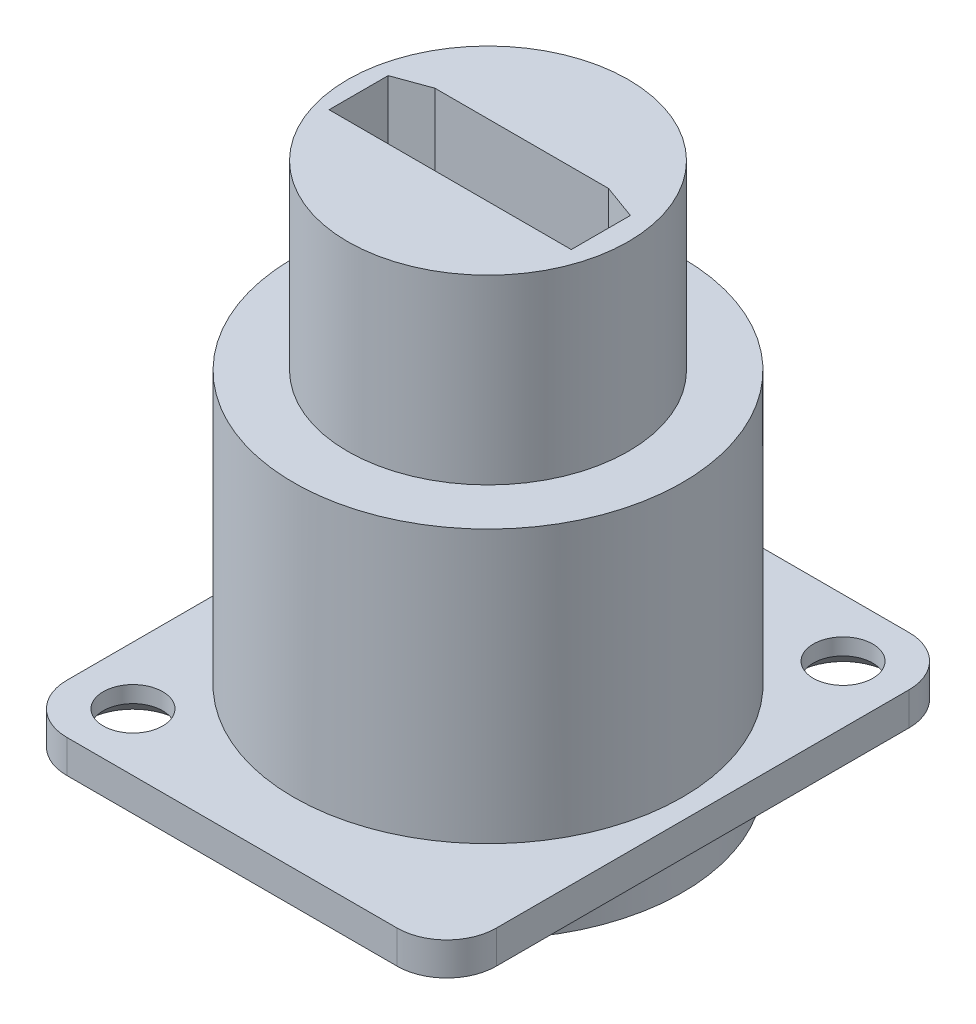
ISO-10303-21;
HEADER;
FILE_DESCRIPTION(('STEP AP214'),'2;1');
FILE_NAME('part.step','',(''),(''),'','','');
FILE_SCHEMA(('AUTOMOTIVE_DESIGN { 1 0 10303 214 1 1 1 1 }'));
ENDSEC;
DATA;
#1=APPLICATION_CONTEXT('core data for automotive mechanical design processes');
#2=APPLICATION_PROTOCOL_DEFINITION('international standard','automotive_design',2000,#1);
#3=PRODUCT_CONTEXT('',#1,'mechanical');
#4=PRODUCT('Part','Part','',(#3));
#5=PRODUCT_RELATED_PRODUCT_CATEGORY('part','',(#4));
#6=PRODUCT_DEFINITION_FORMATION('','',#4);
#7=PRODUCT_DEFINITION_CONTEXT('part definition',#1,'design');
#8=PRODUCT_DEFINITION('design','',#6,#7);
#9=PRODUCT_DEFINITION_SHAPE('','',#8);
#10=(LENGTH_UNIT() NAMED_UNIT(*) SI_UNIT(.MILLI.,.METRE.));
#11=(NAMED_UNIT(*) PLANE_ANGLE_UNIT() SI_UNIT($,.RADIAN.));
#12=(NAMED_UNIT(*) SI_UNIT($,.STERADIAN.) SOLID_ANGLE_UNIT());
#13=UNCERTAINTY_MEASURE_WITH_UNIT(LENGTH_MEASURE(1.E-05),#10,'distance_accuracy_value','');
#14=(GEOMETRIC_REPRESENTATION_CONTEXT(3) GLOBAL_UNCERTAINTY_ASSIGNED_CONTEXT((#13)) GLOBAL_UNIT_ASSIGNED_CONTEXT((#10,
#11,#12)) REPRESENTATION_CONTEXT('',''));
#15=CARTESIAN_POINT('',(0.,0.,0.));
#16=DIRECTION('',(0.,0.,1.));
#17=DIRECTION('',(1.,0.,0.));
#18=AXIS2_PLACEMENT_3D('',#15,#16,#17);
#19=CARTESIAN_POINT('',(0.,2.,0.));
#20=DIRECTION('',(1.,0.,0.));
#21=DIRECTION('',(0.,0.,-1.));
#22=AXIS2_PLACEMENT_3D('',#19,#20,#21);
#23=PLANE('',#22);
#24=DIRECTION('',(0.,0.,1.));
#25=VECTOR('',#24,1.);
#26=CARTESIAN_POINT('',(0.,0.,0.));
#27=LINE('',#26,#25);
#28=CARTESIAN_POINT('',(0.,0.,3.));
#29=VERTEX_POINT('',#28);
#30=CARTESIAN_POINT('',(0.,0.,28.));
#31=VERTEX_POINT('',#30);
#32=EDGE_CURVE('E319',#29,#31,#27,.T.);
#33=ORIENTED_EDGE('',*,*,#32,.T.);
#34=DIRECTION('',(0.,-1.,0.));
#35=VECTOR('',#34,1.);
#36=CARTESIAN_POINT('',(0.,2.,28.));
#37=LINE('',#36,#35);
#38=CARTESIAN_POINT('',(0.,2.,28.));
#39=VERTEX_POINT('',#38);
#40=EDGE_CURVE('E374',#31,#39,#37,.F.);
#41=ORIENTED_EDGE('',*,*,#40,.T.);
#42=DIRECTION('',(0.,0.,1.));
#43=VECTOR('',#42,1.);
#44=CARTESIAN_POINT('',(0.,2.,0.));
#45=LINE('',#44,#43);
#46=CARTESIAN_POINT('',(0.,2.,3.));
#47=VERTEX_POINT('',#46);
#48=EDGE_CURVE('E308',#47,#39,#45,.T.);
#49=ORIENTED_EDGE('',*,*,#48,.F.);
#50=DIRECTION('',(0.,-1.,0.));
#51=VECTOR('',#50,1.);
#52=CARTESIAN_POINT('',(0.,2.,3.));
#53=LINE('',#52,#51);
#54=EDGE_CURVE('E371',#47,#29,#53,.T.);
#55=ORIENTED_EDGE('',*,*,#54,.T.);
#56=EDGE_LOOP('',(#33,#41,#49,#55));
#57=FACE_BOUND('',#56,.T.);
#58=ADVANCED_FACE('F36',(#57),#23,.F.);
#59=CARTESIAN_POINT('',(0.,2.,31.));
#60=DIRECTION('',(0.,0.,-1.));
#61=DIRECTION('',(-1.,0.,0.));
#62=AXIS2_PLACEMENT_3D('',#59,#60,#61);
#63=PLANE('',#62);
#64=DIRECTION('',(1.,0.,0.));
#65=VECTOR('',#64,1.);
#66=CARTESIAN_POINT('',(0.,0.,31.));
#67=LINE('',#66,#65);
#68=CARTESIAN_POINT('',(3.,0.,31.));
#69=VERTEX_POINT('',#68);
#70=CARTESIAN_POINT('',(23.,0.,31.));
#71=VERTEX_POINT('',#70);
#72=EDGE_CURVE('E322',#69,#71,#67,.T.);
#73=ORIENTED_EDGE('',*,*,#72,.T.);
#74=DIRECTION('',(0.,-1.,0.));
#75=VECTOR('',#74,1.);
#76=CARTESIAN_POINT('',(23.,2.,31.));
#77=LINE('',#76,#75);
#78=CARTESIAN_POINT('',(23.,2.,31.));
#79=VERTEX_POINT('',#78);
#80=EDGE_CURVE('E361',#71,#79,#77,.F.);
#81=ORIENTED_EDGE('',*,*,#80,.T.);
#82=DIRECTION('',(1.,0.,0.));
#83=VECTOR('',#82,1.);
#84=CARTESIAN_POINT('',(0.,2.,31.));
#85=LINE('',#84,#83);
#86=CARTESIAN_POINT('',(3.,2.,31.));
#87=VERTEX_POINT('',#86);
#88=EDGE_CURVE('E311',#87,#79,#85,.T.);
#89=ORIENTED_EDGE('',*,*,#88,.F.);
#90=DIRECTION('',(0.,-1.,0.));
#91=VECTOR('',#90,1.);
#92=CARTESIAN_POINT('',(3.,2.,31.));
#93=LINE('',#92,#91);
#94=EDGE_CURVE('E358',#87,#69,#93,.T.);
#95=ORIENTED_EDGE('',*,*,#94,.T.);
#96=EDGE_LOOP('',(#73,#81,#89,#95));
#97=FACE_BOUND('',#96,.T.);
#98=ADVANCED_FACE('F401',(#97),#63,.F.);
#99=CARTESIAN_POINT('',(26.,2.,0.));
#100=DIRECTION('',(-1.,0.,0.));
#101=DIRECTION('',(0.,0.,1.));
#102=AXIS2_PLACEMENT_3D('',#99,#100,#101);
#103=PLANE('',#102);
#104=DIRECTION('',(0.,0.,-1.));
#105=VECTOR('',#104,1.);
#106=CARTESIAN_POINT('',(26.,2.,0.));
#107=LINE('',#106,#105);
#108=CARTESIAN_POINT('',(26.,2.,28.));
#109=VERTEX_POINT('',#108);
#110=CARTESIAN_POINT('',(26.,2.,3.));
#111=VERTEX_POINT('',#110);
#112=EDGE_CURVE('E315',#109,#111,#107,.T.);
#113=ORIENTED_EDGE('',*,*,#112,.F.);
#114=DIRECTION('',(0.,-1.,0.));
#115=VECTOR('',#114,1.);
#116=CARTESIAN_POINT('',(26.,2.,28.));
#117=LINE('',#116,#115);
#118=CARTESIAN_POINT('',(26.,0.,28.));
#119=VERTEX_POINT('',#118);
#120=EDGE_CURVE('E347',#109,#119,#117,.T.);
#121=ORIENTED_EDGE('',*,*,#120,.T.);
#122=DIRECTION('',(0.,0.,-1.));
#123=VECTOR('',#122,1.);
#124=CARTESIAN_POINT('',(26.,0.,0.));
#125=LINE('',#124,#123);
#126=CARTESIAN_POINT('',(26.,0.,3.));
#127=VERTEX_POINT('',#126);
#128=EDGE_CURVE('E325',#119,#127,#125,.T.);
#129=ORIENTED_EDGE('',*,*,#128,.T.);
#130=DIRECTION('',(0.,-1.,0.));
#131=VECTOR('',#130,1.);
#132=CARTESIAN_POINT('',(26.,2.,3.));
#133=LINE('',#132,#131);
#134=EDGE_CURVE('E345',#127,#111,#133,.F.);
#135=ORIENTED_EDGE('',*,*,#134,.T.);
#136=EDGE_LOOP('',(#113,#121,#129,#135));
#137=FACE_BOUND('',#136,.T.);
#138=ADVANCED_FACE('F409',(#137),#103,.F.);
#139=CARTESIAN_POINT('',(0.,2.,0.));
#140=DIRECTION('',(0.,0.,1.));
#141=DIRECTION('',(1.,0.,0.));
#142=AXIS2_PLACEMENT_3D('',#139,#140,#141);
#143=PLANE('',#142);
#144=DIRECTION('',(-1.,0.,0.));
#145=VECTOR('',#144,1.);
#146=CARTESIAN_POINT('',(0.,0.,0.));
#147=LINE('',#146,#145);
#148=CARTESIAN_POINT('',(23.,0.,0.));
#149=VERTEX_POINT('',#148);
#150=CARTESIAN_POINT('',(3.,0.,0.));
#151=VERTEX_POINT('',#150);
#152=EDGE_CURVE('E312',#149,#151,#147,.T.);
#153=ORIENTED_EDGE('',*,*,#152,.T.);
#154=DIRECTION('',(0.,-1.,0.));
#155=VECTOR('',#154,1.);
#156=CARTESIAN_POINT('',(3.,2.,0.));
#157=LINE('',#156,#155);
#158=CARTESIAN_POINT('',(3.,2.,0.));
#159=VERTEX_POINT('',#158);
#160=EDGE_CURVE('E11',#151,#159,#157,.F.);
#161=ORIENTED_EDGE('',*,*,#160,.T.);
#162=DIRECTION('',(-1.,0.,0.));
#163=VECTOR('',#162,1.);
#164=CARTESIAN_POINT('',(0.,2.,0.));
#165=LINE('',#164,#163);
#166=CARTESIAN_POINT('',(23.,2.,0.));
#167=VERTEX_POINT('',#166);
#168=EDGE_CURVE('E307',#167,#159,#165,.T.);
#169=ORIENTED_EDGE('',*,*,#168,.F.);
#170=DIRECTION('',(0.,-1.,0.));
#171=VECTOR('',#170,1.);
#172=CARTESIAN_POINT('',(23.,2.,0.));
#173=LINE('',#172,#171);
#174=EDGE_CURVE('E44',#167,#149,#173,.T.);
#175=ORIENTED_EDGE('',*,*,#174,.T.);
#176=EDGE_LOOP('',(#153,#161,#169,#175));
#177=FACE_BOUND('',#176,.T.);
#178=ADVANCED_FACE('F378',(#177),#143,.F.);
#179=CARTESIAN_POINT('',(0.,2.,0.));
#180=DIRECTION('',(0.,1.,0.));
#181=DIRECTION('',(0.,0.,1.));
#182=AXIS2_PLACEMENT_3D('',#179,#180,#181);
#183=PLANE('',#182);
#184=CARTESIAN_POINT('',(22.5,2.,3.5));
#185=DIRECTION('',(0.,1.,0.));
#186=DIRECTION('',(0.,0.,1.));
#187=AXIS2_PLACEMENT_3D('',#184,#185,#186);
#188=CIRCLE('',#187,1.8);
#189=CARTESIAN_POINT('',(22.5,2.,5.3));
#190=VERTEX_POINT('',#189);
#191=EDGE_CURVE('E220',#190,#190,#188,.T.);
#192=ORIENTED_EDGE('',*,*,#191,.F.);
#193=EDGE_LOOP('',(#192));
#194=FACE_BOUND('',#193,.T.);
#195=CARTESIAN_POINT('',(3.5,2.,27.5));
#196=DIRECTION('',(0.,1.,0.));
#197=DIRECTION('',(0.,0.,1.));
#198=AXIS2_PLACEMENT_3D('',#195,#196,#197);
#199=CIRCLE('',#198,1.8);
#200=CARTESIAN_POINT('',(3.5,2.,29.3));
#201=VERTEX_POINT('',#200);
#202=EDGE_CURVE('E230',#201,#201,#199,.T.);
#203=ORIENTED_EDGE('',*,*,#202,.F.);
#204=EDGE_LOOP('',(#203));
#205=FACE_BOUND('',#204,.T.);
#206=CARTESIAN_POINT('',(13.,2.,15.5));
#207=DIRECTION('',(0.,1.,0.));
#208=DIRECTION('',(0.,0.,1.));
#209=AXIS2_PLACEMENT_3D('',#206,#207,#208);
#210=CIRCLE('',#209,11.775);
#211=CARTESIAN_POINT('',(13.,2.,27.275));
#212=VERTEX_POINT('',#211);
#213=EDGE_CURVE('E303',#212,#212,#210,.T.);
#214=ORIENTED_EDGE('',*,*,#213,.F.);
#215=EDGE_LOOP('',(#214));
#216=FACE_BOUND('',#215,.T.);
#217=ORIENTED_EDGE('',*,*,#88,.T.);
#218=CARTESIAN_POINT('',(23.,2.,28.));
#219=DIRECTION('',(0.,1.,0.));
#220=DIRECTION('',(0.,0.,1.));
#221=AXIS2_PLACEMENT_3D('',#218,#219,#220);
#222=CIRCLE('',#221,3.);
#223=EDGE_CURVE('E369',#79,#109,#222,.T.);
#224=ORIENTED_EDGE('',*,*,#223,.T.);
#225=ORIENTED_EDGE('',*,*,#112,.T.);
#226=CARTESIAN_POINT('',(23.,2.,3.));
#227=DIRECTION('',(0.,1.,0.));
#228=DIRECTION('',(0.,0.,1.));
#229=AXIS2_PLACEMENT_3D('',#226,#227,#228);
#230=CIRCLE('',#229,3.);
#231=EDGE_CURVE('E363',#111,#167,#230,.T.);
#232=ORIENTED_EDGE('',*,*,#231,.T.);
#233=ORIENTED_EDGE('',*,*,#168,.T.);
#234=CARTESIAN_POINT('',(3.,2.,3.));
#235=DIRECTION('',(0.,1.,0.));
#236=DIRECTION('',(0.,0.,1.));
#237=AXIS2_PLACEMENT_3D('',#234,#235,#236);
#238=CIRCLE('',#237,3.);
#239=EDGE_CURVE('E365',#159,#47,#238,.T.);
#240=ORIENTED_EDGE('',*,*,#239,.T.);
#241=ORIENTED_EDGE('',*,*,#48,.T.);
#242=CARTESIAN_POINT('',(3.,2.,28.));
#243=DIRECTION('',(0.,1.,0.));
#244=DIRECTION('',(0.,0.,1.));
#245=AXIS2_PLACEMENT_3D('',#242,#243,#244);
#246=CIRCLE('',#245,3.);
#247=EDGE_CURVE('E367',#39,#87,#246,.T.);
#248=ORIENTED_EDGE('',*,*,#247,.T.);
#249=EDGE_LOOP('',(#217,#224,#225,#232,#233,#240,#241,#248));
#250=FACE_BOUND('',#249,.T.);
#251=ADVANCED_FACE('F394',(#194,#205,#216,#250),#183,.T.);
#252=CARTESIAN_POINT('',(0.,0.,0.));
#253=DIRECTION('',(0.,1.,0.));
#254=DIRECTION('',(0.,0.,1.));
#255=AXIS2_PLACEMENT_3D('',#252,#253,#254);
#256=PLANE('',#255);
#257=CARTESIAN_POINT('',(22.5,0.,3.5));
#258=DIRECTION('',(0.,1.,0.));
#259=DIRECTION('',(0.,0.,1.));
#260=AXIS2_PLACEMENT_3D('',#257,#258,#259);
#261=CIRCLE('',#260,2.80000000000002);
#262=CARTESIAN_POINT('',(22.5,0.,6.30000000000002));
#263=VERTEX_POINT('',#262);
#264=EDGE_CURVE('E339',#263,#263,#261,.T.);
#265=ORIENTED_EDGE('',*,*,#264,.T.);
#266=EDGE_LOOP('',(#265));
#267=FACE_BOUND('',#266,.T.);
#268=CARTESIAN_POINT('',(3.5,0.,27.5));
#269=DIRECTION('',(0.,1.,0.));
#270=DIRECTION('',(0.,0.,1.));
#271=AXIS2_PLACEMENT_3D('',#268,#269,#270);
#272=CIRCLE('',#271,2.80000000000002);
#273=CARTESIAN_POINT('',(3.5,0.,30.3));
#274=VERTEX_POINT('',#273);
#275=EDGE_CURVE('E336',#274,#274,#272,.T.);
#276=ORIENTED_EDGE('',*,*,#275,.T.);
#277=EDGE_LOOP('',(#276));
#278=FACE_BOUND('',#277,.T.);
#279=CARTESIAN_POINT('',(13.,0.,15.5));
#280=DIRECTION('',(0.,1.,0.));
#281=DIRECTION('',(0.,0.,1.));
#282=AXIS2_PLACEMENT_3D('',#279,#280,#281);
#283=CIRCLE('',#282,11.775);
#284=CARTESIAN_POINT('',(13.,0.,27.275));
#285=VERTEX_POINT('',#284);
#286=EDGE_CURVE('E302',#285,#285,#283,.T.);
#287=ORIENTED_EDGE('',*,*,#286,.T.);
#288=EDGE_LOOP('',(#287));
#289=FACE_BOUND('',#288,.T.);
#290=ORIENTED_EDGE('',*,*,#128,.F.);
#291=CARTESIAN_POINT('',(23.,0.,28.));
#292=DIRECTION('',(0.,1.,0.));
#293=DIRECTION('',(0.,0.,1.));
#294=AXIS2_PLACEMENT_3D('',#291,#292,#293);
#295=CIRCLE('',#294,3.);
#296=EDGE_CURVE('E356',#119,#71,#295,.F.);
#297=ORIENTED_EDGE('',*,*,#296,.T.);
#298=ORIENTED_EDGE('',*,*,#72,.F.);
#299=CARTESIAN_POINT('',(3.,0.,28.));
#300=DIRECTION('',(0.,1.,0.));
#301=DIRECTION('',(0.,0.,1.));
#302=AXIS2_PLACEMENT_3D('',#299,#300,#301);
#303=CIRCLE('',#302,3.);
#304=EDGE_CURVE('E354',#69,#31,#303,.F.);
#305=ORIENTED_EDGE('',*,*,#304,.T.);
#306=ORIENTED_EDGE('',*,*,#32,.F.);
#307=CARTESIAN_POINT('',(3.,0.,3.));
#308=DIRECTION('',(0.,1.,0.));
#309=DIRECTION('',(0.,0.,1.));
#310=AXIS2_PLACEMENT_3D('',#307,#308,#309);
#311=CIRCLE('',#310,3.);
#312=EDGE_CURVE('E352',#29,#151,#311,.F.);
#313=ORIENTED_EDGE('',*,*,#312,.T.);
#314=ORIENTED_EDGE('',*,*,#152,.F.);
#315=CARTESIAN_POINT('',(23.,0.,3.));
#316=DIRECTION('',(0.,1.,0.));
#317=DIRECTION('',(0.,0.,1.));
#318=AXIS2_PLACEMENT_3D('',#315,#316,#317);
#319=CIRCLE('',#318,3.);
#320=EDGE_CURVE('E350',#149,#127,#319,.F.);
#321=ORIENTED_EDGE('',*,*,#320,.T.);
#322=EDGE_LOOP('',(#290,#297,#298,#305,#306,#313,#314,#321));
#323=FACE_BOUND('',#322,.T.);
#324=ADVANCED_FACE('F383',(#267,#278,#289,#323),#256,.F.);
#325=CARTESIAN_POINT('',(13.,-3.,15.5));
#326=DIRECTION('',(0.,-1.,0.));
#327=DIRECTION('',(0.,0.,-1.));
#328=AXIS2_PLACEMENT_3D('',#325,#326,#327);
#329=PLANE('',#328);
#330=CARTESIAN_POINT('',(13.,-3.,15.5));
#331=DIRECTION('',(0.,-1.,0.));
#332=DIRECTION('',(0.,0.,-1.));
#333=AXIS2_PLACEMENT_3D('',#330,#331,#332);
#334=CIRCLE('',#333,10.);
#335=CARTESIAN_POINT('',(13.,-3.,5.5));
#336=VERTEX_POINT('',#335);
#337=EDGE_CURVE('E285',#336,#336,#334,.T.);
#338=ORIENTED_EDGE('',*,*,#337,.F.);
#339=EDGE_LOOP('',(#338));
#340=FACE_BOUND('',#339,.T.);
#341=CARTESIAN_POINT('',(13.,-3.,15.5));
#342=DIRECTION('',(0.,-1.,0.));
#343=DIRECTION('',(0.,0.,-1.));
#344=AXIS2_PLACEMENT_3D('',#341,#342,#343);
#345=CIRCLE('',#344,11.775);
#346=CARTESIAN_POINT('',(13.,-3.,3.725));
#347=VERTEX_POINT('',#346);
#348=EDGE_CURVE('E296',#347,#347,#345,.T.);
#349=ORIENTED_EDGE('',*,*,#348,.T.);
#350=EDGE_LOOP('',(#349));
#351=FACE_BOUND('',#350,.T.);
#352=ADVANCED_FACE('F581',(#340,#351),#329,.T.);
#353=CARTESIAN_POINT('',(13.,18.5,15.5));
#354=DIRECTION('',(0.,-1.,0.));
#355=DIRECTION('',(0.,0.,-1.));
#356=AXIS2_PLACEMENT_3D('',#353,#354,#355);
#357=CYLINDRICAL_SURFACE('',#356,11.775);
#358=ORIENTED_EDGE('',*,*,#348,.F.);
#359=EDGE_LOOP('',(#358));
#360=FACE_BOUND('',#359,.T.);
#361=ORIENTED_EDGE('',*,*,#286,.F.);
#362=EDGE_LOOP('',(#361));
#363=FACE_BOUND('',#362,.T.);
#364=ADVANCED_FACE('F584',(#360,#363),#357,.T.);
#365=ORIENTED_EDGE('',*,*,#213,.T.);
#366=EDGE_LOOP('',(#365));
#367=FACE_BOUND('',#366,.T.);
#368=CARTESIAN_POINT('',(13.,18.5,15.5));
#369=DIRECTION('',(0.,-1.,0.));
#370=DIRECTION('',(0.,0.,-1.));
#371=AXIS2_PLACEMENT_3D('',#368,#369,#370);
#372=CIRCLE('',#371,11.775);
#373=CARTESIAN_POINT('',(13.,18.5,3.725));
#374=VERTEX_POINT('',#373);
#375=EDGE_CURVE('E299',#374,#374,#372,.T.);
#376=ORIENTED_EDGE('',*,*,#375,.T.);
#377=EDGE_LOOP('',(#376));
#378=FACE_BOUND('',#377,.T.);
#379=ADVANCED_FACE('F588',(#367,#378),#357,.T.);
#380=CARTESIAN_POINT('',(13.,18.5,15.5));
#381=DIRECTION('',(0.,-1.,0.));
#382=DIRECTION('',(0.,0.,-1.));
#383=AXIS2_PLACEMENT_3D('',#380,#381,#382);
#384=PLANE('',#383);
#385=CARTESIAN_POINT('',(13.,18.5,15.5));
#386=DIRECTION('',(0.,-1.,0.));
#387=DIRECTION('',(0.,0.,-1.));
#388=AXIS2_PLACEMENT_3D('',#385,#386,#387);
#389=CIRCLE('',#388,8.5);
#390=CARTESIAN_POINT('',(13.,18.5,7.));
#391=VERTEX_POINT('',#390);
#392=EDGE_CURVE('E306',#391,#391,#389,.F.);
#393=ORIENTED_EDGE('',*,*,#392,.F.);
#394=EDGE_LOOP('',(#393));
#395=FACE_BOUND('',#394,.T.);
#396=ORIENTED_EDGE('',*,*,#375,.F.);
#397=EDGE_LOOP('',(#396));
#398=FACE_BOUND('',#397,.T.);
#399=ADVANCED_FACE('F579',(#395,#398),#384,.F.);
#400=CARTESIAN_POINT('',(13.,29.5,15.5));
#401=DIRECTION('',(0.,-1.,0.));
#402=DIRECTION('',(0.,0.,-1.));
#403=AXIS2_PLACEMENT_3D('',#400,#401,#402);
#404=CYLINDRICAL_SURFACE('',#403,8.5);
#405=CARTESIAN_POINT('',(13.,29.5,15.5));
#406=DIRECTION('',(0.,1.,0.));
#407=DIRECTION('',(0.,0.,1.));
#408=AXIS2_PLACEMENT_3D('',#405,#406,#407);
#409=CIRCLE('',#408,8.5);
#410=CARTESIAN_POINT('',(13.,29.5,24.));
#411=VERTEX_POINT('',#410);
#412=EDGE_CURVE('E291',#411,#411,#409,.T.);
#413=ORIENTED_EDGE('',*,*,#412,.F.);
#414=EDGE_LOOP('',(#413));
#415=FACE_BOUND('',#414,.T.);
#416=ORIENTED_EDGE('',*,*,#392,.T.);
#417=EDGE_LOOP('',(#416));
#418=FACE_BOUND('',#417,.T.);
#419=ADVANCED_FACE('F462',(#415,#418),#404,.T.);
#420=CARTESIAN_POINT('',(13.,29.5,15.5));
#421=DIRECTION('',(0.,1.,0.));
#422=DIRECTION('',(0.,0.,1.));
#423=AXIS2_PLACEMENT_3D('',#420,#421,#422);
#424=PLANE('',#423);
#425=DIRECTION('',(1.,0.,0.));
#426=VECTOR('',#425,1.);
#427=CARTESIAN_POINT('',(5.51929511315663,29.5,17.6438599667552));
#428=LINE('',#427,#426);
#429=CARTESIAN_POINT('',(5.51929511315663,29.5,17.6438599667552));
#430=VERTEX_POINT('',#429);
#431=CARTESIAN_POINT('',(20.1870832638669,29.5,17.6438599667552));
#432=VERTEX_POINT('',#431);
#433=EDGE_CURVE('E51',#430,#432,#428,.T.);
#434=ORIENTED_EDGE('',*,*,#433,.F.);
#435=DIRECTION('',(0.,0.,1.));
#436=VECTOR('',#435,1.);
#437=CARTESIAN_POINT('',(5.51929511315663,29.5,14.0654876489084));
#438=LINE('',#437,#436);
#439=CARTESIAN_POINT('',(5.51929511315663,29.5,14.0654876489084));
#440=VERTEX_POINT('',#439);
#441=EDGE_CURVE('E194',#440,#430,#438,.T.);
#442=ORIENTED_EDGE('',*,*,#441,.F.);
#443=DIRECTION('',(-0.939692620785909,0.,0.342020143325666));
#444=VECTOR('',#443,1.);
#445=CARTESIAN_POINT('',(7.59666718443264,29.5,13.309386049468));
#446=LINE('',#445,#444);
#447=CARTESIAN_POINT('',(7.59666718443264,29.5,13.309386049468));
#448=VERTEX_POINT('',#447);
#449=EDGE_CURVE('E197',#448,#440,#446,.T.);
#450=ORIENTED_EDGE('',*,*,#449,.F.);
#451=DIRECTION('',(-1.,0.,0.));
#452=VECTOR('',#451,1.);
#453=CARTESIAN_POINT('',(18.1097111925909,29.5,13.309386049468));
#454=LINE('',#453,#452);
#455=CARTESIAN_POINT('',(18.1097111925909,29.5,13.309386049468));
#456=VERTEX_POINT('',#455);
#457=EDGE_CURVE('E213',#456,#448,#454,.T.);
#458=ORIENTED_EDGE('',*,*,#457,.F.);
#459=DIRECTION('',(-0.939692620785907,0.,-0.342020143325672));
#460=VECTOR('',#459,1.);
#461=CARTESIAN_POINT('',(20.1870832638669,29.5,14.0654876489084));
#462=LINE('',#461,#460);
#463=CARTESIAN_POINT('',(20.1870832638669,29.5,14.0654876489084));
#464=VERTEX_POINT('',#463);
#465=EDGE_CURVE('E210',#464,#456,#462,.T.);
#466=ORIENTED_EDGE('',*,*,#465,.F.);
#467=DIRECTION('',(0.,0.,-1.));
#468=VECTOR('',#467,1.);
#469=CARTESIAN_POINT('',(20.1870832638669,29.5,17.6438599667552));
#470=LINE('',#469,#468);
#471=EDGE_CURVE('E208',#432,#464,#470,.T.);
#472=ORIENTED_EDGE('',*,*,#471,.F.);
#473=EDGE_LOOP('',(#434,#442,#450,#458,#466,#472));
#474=FACE_BOUND('',#473,.T.);
#475=ORIENTED_EDGE('',*,*,#412,.T.);
#476=EDGE_LOOP('',(#475));
#477=FACE_BOUND('',#476,.T.);
#478=ADVANCED_FACE('F456',(#474,#477),#424,.T.);
#479=CARTESIAN_POINT('',(13.,12.,15.5));
#480=DIRECTION('',(0.,-1.,0.));
#481=DIRECTION('',(0.,0.,-1.));
#482=AXIS2_PLACEMENT_3D('',#479,#480,#481);
#483=CYLINDRICAL_SURFACE('',#482,10.);
#484=CARTESIAN_POINT('',(13.,12.,15.5));
#485=DIRECTION('',(0.,-1.,0.));
#486=DIRECTION('',(0.,0.,-1.));
#487=AXIS2_PLACEMENT_3D('',#484,#485,#486);
#488=CIRCLE('',#487,10.);
#489=CARTESIAN_POINT('',(13.,12.,5.5));
#490=VERTEX_POINT('',#489);
#491=EDGE_CURVE('E288',#490,#490,#488,.T.);
#492=ORIENTED_EDGE('',*,*,#491,.F.);
#493=EDGE_LOOP('',(#492));
#494=FACE_BOUND('',#493,.T.);
#495=ORIENTED_EDGE('',*,*,#337,.T.);
#496=EDGE_LOOP('',(#495));
#497=FACE_BOUND('',#496,.T.);
#498=ADVANCED_FACE('F461',(#494,#497),#483,.F.);
#499=CARTESIAN_POINT('',(13.,12.,15.5));
#500=DIRECTION('',(0.,-1.,0.));
#501=DIRECTION('',(0.,0.,-1.));
#502=AXIS2_PLACEMENT_3D('',#499,#500,#501);
#503=PLANE('',#502);
#504=CARTESIAN_POINT('',(13.,12.,15.5));
#505=DIRECTION('',(0.,-1.,0.));
#506=DIRECTION('',(0.,0.,-1.));
#507=AXIS2_PLACEMENT_3D('',#504,#505,#506);
#508=CIRCLE('',#507,8.5);
#509=CARTESIAN_POINT('',(13.,12.,7.));
#510=VERTEX_POINT('',#509);
#511=EDGE_CURVE('E282',#510,#510,#508,.T.);
#512=ORIENTED_EDGE('',*,*,#511,.F.);
#513=EDGE_LOOP('',(#512));
#514=FACE_BOUND('',#513,.T.);
#515=ORIENTED_EDGE('',*,*,#491,.T.);
#516=EDGE_LOOP('',(#515));
#517=FACE_BOUND('',#516,.T.);
#518=ADVANCED_FACE('F571',(#514,#517),#503,.T.);
#519=CARTESIAN_POINT('',(13.,12.,15.5));
#520=DIRECTION('',(0.,-1.,0.));
#521=DIRECTION('',(0.,0.,-1.));
#522=AXIS2_PLACEMENT_3D('',#519,#520,#521);
#523=CYLINDRICAL_SURFACE('',#522,8.5);
#524=ORIENTED_EDGE('',*,*,#511,.T.);
#525=EDGE_LOOP('',(#524));
#526=FACE_BOUND('',#525,.T.);
#527=CARTESIAN_POINT('',(13.,-3.,15.5));
#528=DIRECTION('',(0.,-1.,0.));
#529=DIRECTION('',(0.,0.,-1.));
#530=AXIS2_PLACEMENT_3D('',#527,#528,#529);
#531=CIRCLE('',#530,8.5);
#532=CARTESIAN_POINT('',(13.,-3.,7.));
#533=VERTEX_POINT('',#532);
#534=EDGE_CURVE('E271',#533,#533,#531,.T.);
#535=ORIENTED_EDGE('',*,*,#534,.F.);
#536=EDGE_LOOP('',(#535));
#537=FACE_BOUND('',#536,.T.);
#538=ADVANCED_FACE('F568',(#526,#537),#523,.T.);
#539=DIRECTION('',(0.,0.,-1.));
#540=VECTOR('',#539,1.);
#541=CARTESIAN_POINT('',(5.51929511315663,-3.,17.6438599667552));
#542=LINE('',#541,#540);
#543=CARTESIAN_POINT('',(5.51929511315663,-3.,17.6438599667552));
#544=VERTEX_POINT('',#543);
#545=CARTESIAN_POINT('',(5.51929511315663,-3.,14.0654876489084));
#546=VERTEX_POINT('',#545);
#547=EDGE_CURVE('E233',#544,#546,#542,.T.);
#548=ORIENTED_EDGE('',*,*,#547,.F.);
#549=DIRECTION('',(-1.,0.,0.));
#550=VECTOR('',#549,1.);
#551=CARTESIAN_POINT('',(5.51929511315663,-3.,17.6438599667552));
#552=LINE('',#551,#550);
#553=CARTESIAN_POINT('',(20.1870832638669,-3.,17.6438599667552));
#554=VERTEX_POINT('',#553);
#555=EDGE_CURVE('E238',#554,#544,#552,.T.);
#556=ORIENTED_EDGE('',*,*,#555,.F.);
#557=DIRECTION('',(0.,0.,1.));
#558=VECTOR('',#557,1.);
#559=CARTESIAN_POINT('',(20.1870832638669,-3.,17.6438599667552));
#560=LINE('',#559,#558);
#561=CARTESIAN_POINT('',(20.1870832638669,-3.,14.0654876489084));
#562=VERTEX_POINT('',#561);
#563=EDGE_CURVE('E264',#562,#554,#560,.T.);
#564=ORIENTED_EDGE('',*,*,#563,.F.);
#565=DIRECTION('',(0.939692620785907,0.,0.342020143325672));
#566=VECTOR('',#565,1.);
#567=CARTESIAN_POINT('',(18.1097111925909,-3.,13.309386049468));
#568=LINE('',#567,#566);
#569=CARTESIAN_POINT('',(18.1097111925909,-3.,13.309386049468));
#570=VERTEX_POINT('',#569);
#571=EDGE_CURVE('E261',#570,#562,#568,.T.);
#572=ORIENTED_EDGE('',*,*,#571,.F.);
#573=DIRECTION('',(1.,0.,0.));
#574=VECTOR('',#573,1.);
#575=CARTESIAN_POINT('',(7.59666718443264,-3.,13.309386049468));
#576=LINE('',#575,#574);
#577=CARTESIAN_POINT('',(7.59666718443264,-3.,13.309386049468));
#578=VERTEX_POINT('',#577);
#579=EDGE_CURVE('E258',#578,#570,#576,.T.);
#580=ORIENTED_EDGE('',*,*,#579,.F.);
#581=DIRECTION('',(0.939692620785909,0.,-0.342020143325666));
#582=VECTOR('',#581,1.);
#583=CARTESIAN_POINT('',(5.51929511315663,-3.,14.0654876489084));
#584=LINE('',#583,#582);
#585=EDGE_CURVE('E255',#546,#578,#584,.T.);
#586=ORIENTED_EDGE('',*,*,#585,.F.);
#587=EDGE_LOOP('',(#548,#556,#564,#572,#580,#586));
#588=FACE_BOUND('',#587,.T.);
#589=ORIENTED_EDGE('',*,*,#534,.T.);
#590=EDGE_LOOP('',(#589));
#591=FACE_BOUND('',#590,.T.);
#592=ADVANCED_FACE('F566',(#588,#591),#329,.T.);
#593=CARTESIAN_POINT('',(5.51929511315663,7.,17.6438599667552));
#594=DIRECTION('',(-1.,0.,0.));
#595=DIRECTION('',(0.,0.,1.));
#596=AXIS2_PLACEMENT_3D('',#593,#594,#595);
#597=PLANE('',#596);
#598=ORIENTED_EDGE('',*,*,#547,.T.);
#599=DIRECTION('',(0.,-1.,0.));
#600=VECTOR('',#599,1.);
#601=CARTESIAN_POINT('',(5.51929511315663,7.,14.0654876489084));
#602=LINE('',#601,#600);
#603=CARTESIAN_POINT('',(5.51929511315663,7.,14.0654876489084));
#604=VERTEX_POINT('',#603);
#605=EDGE_CURVE('E253',#604,#546,#602,.T.);
#606=ORIENTED_EDGE('',*,*,#605,.F.);
#607=DIRECTION('',(0.,0.,-1.));
#608=VECTOR('',#607,1.);
#609=CARTESIAN_POINT('',(5.51929511315663,7.,17.6438599667552));
#610=LINE('',#609,#608);
#611=CARTESIAN_POINT('',(5.51929511315663,7.,17.6438599667552));
#612=VERTEX_POINT('',#611);
#613=EDGE_CURVE('E234',#612,#604,#610,.T.);
#614=ORIENTED_EDGE('',*,*,#613,.F.);
#615=DIRECTION('',(0.,-1.,0.));
#616=VECTOR('',#615,1.);
#617=CARTESIAN_POINT('',(5.51929511315663,7.,17.6438599667552));
#618=LINE('',#617,#616);
#619=EDGE_CURVE('E269',#612,#544,#618,.T.);
#620=ORIENTED_EDGE('',*,*,#619,.T.);
#621=EDGE_LOOP('',(#598,#606,#614,#620));
#622=FACE_BOUND('',#621,.T.);
#623=ADVANCED_FACE('F548',(#622),#597,.F.);
#624=CARTESIAN_POINT('',(5.51929511315663,7.,17.6438599667552));
#625=DIRECTION('',(0.,0.,1.));
#626=DIRECTION('',(1.,0.,0.));
#627=AXIS2_PLACEMENT_3D('',#624,#625,#626);
#628=PLANE('',#627);
#629=ORIENTED_EDGE('',*,*,#555,.T.);
#630=ORIENTED_EDGE('',*,*,#619,.F.);
#631=DIRECTION('',(-1.,0.,0.));
#632=VECTOR('',#631,1.);
#633=CARTESIAN_POINT('',(5.51929511315663,7.,17.6438599667552));
#634=LINE('',#633,#632);
#635=CARTESIAN_POINT('',(20.1870832638669,7.,17.6438599667552));
#636=VERTEX_POINT('',#635);
#637=EDGE_CURVE('E250',#636,#612,#634,.T.);
#638=ORIENTED_EDGE('',*,*,#637,.F.);
#639=DIRECTION('',(0.,-1.,0.));
#640=VECTOR('',#639,1.);
#641=CARTESIAN_POINT('',(20.1870832638669,7.,17.6438599667552));
#642=LINE('',#641,#640);
#643=EDGE_CURVE('E272',#636,#554,#642,.T.);
#644=ORIENTED_EDGE('',*,*,#643,.T.);
#645=EDGE_LOOP('',(#629,#630,#638,#644));
#646=FACE_BOUND('',#645,.T.);
#647=ADVANCED_FACE('F544',(#646),#628,.F.);
#648=CARTESIAN_POINT('',(20.1870832638669,7.,17.6438599667552));
#649=DIRECTION('',(1.,0.,0.));
#650=DIRECTION('',(0.,0.,-1.));
#651=AXIS2_PLACEMENT_3D('',#648,#649,#650);
#652=PLANE('',#651);
#653=ORIENTED_EDGE('',*,*,#563,.T.);
#654=ORIENTED_EDGE('',*,*,#643,.F.);
#655=DIRECTION('',(0.,0.,1.));
#656=VECTOR('',#655,1.);
#657=CARTESIAN_POINT('',(20.1870832638669,7.,17.6438599667552));
#658=LINE('',#657,#656);
#659=CARTESIAN_POINT('',(20.1870832638669,7.,14.0654876489084));
#660=VERTEX_POINT('',#659);
#661=EDGE_CURVE('E247',#660,#636,#658,.T.);
#662=ORIENTED_EDGE('',*,*,#661,.F.);
#663=DIRECTION('',(0.,-1.,0.));
#664=VECTOR('',#663,1.);
#665=CARTESIAN_POINT('',(20.1870832638669,7.,14.0654876489084));
#666=LINE('',#665,#664);
#667=EDGE_CURVE('E274',#660,#562,#666,.T.);
#668=ORIENTED_EDGE('',*,*,#667,.T.);
#669=EDGE_LOOP('',(#653,#654,#662,#668));
#670=FACE_BOUND('',#669,.T.);
#671=ADVANCED_FACE('F547',(#670),#652,.F.);
#672=CARTESIAN_POINT('',(18.1097111925909,7.,13.309386049468));
#673=DIRECTION('',(0.342020143325672,0.,-0.939692620785907));
#674=DIRECTION('',(-0.939692620785907,0.,-0.342020143325672));
#675=AXIS2_PLACEMENT_3D('',#672,#673,#674);
#676=PLANE('',#675);
#677=ORIENTED_EDGE('',*,*,#571,.T.);
#678=ORIENTED_EDGE('',*,*,#667,.F.);
#679=DIRECTION('',(0.939692620785907,0.,0.342020143325672));
#680=VECTOR('',#679,1.);
#681=CARTESIAN_POINT('',(18.1097111925909,7.,13.309386049468));
#682=LINE('',#681,#680);
#683=CARTESIAN_POINT('',(18.1097111925909,7.,13.309386049468));
#684=VERTEX_POINT('',#683);
#685=EDGE_CURVE('E244',#684,#660,#682,.T.);
#686=ORIENTED_EDGE('',*,*,#685,.F.);
#687=DIRECTION('',(0.,-1.,0.));
#688=VECTOR('',#687,1.);
#689=CARTESIAN_POINT('',(18.1097111925909,7.,13.309386049468));
#690=LINE('',#689,#688);
#691=EDGE_CURVE('E276',#684,#570,#690,.T.);
#692=ORIENTED_EDGE('',*,*,#691,.T.);
#693=EDGE_LOOP('',(#677,#678,#686,#692));
#694=FACE_BOUND('',#693,.T.);
#695=ADVANCED_FACE('F552',(#694),#676,.F.);
#696=CARTESIAN_POINT('',(7.59666718443264,7.,13.309386049468));
#697=DIRECTION('',(0.,0.,-1.));
#698=DIRECTION('',(-1.,0.,0.));
#699=AXIS2_PLACEMENT_3D('',#696,#697,#698);
#700=PLANE('',#699);
#701=ORIENTED_EDGE('',*,*,#579,.T.);
#702=ORIENTED_EDGE('',*,*,#691,.F.);
#703=DIRECTION('',(1.,0.,0.));
#704=VECTOR('',#703,1.);
#705=CARTESIAN_POINT('',(7.59666718443264,7.,13.309386049468));
#706=LINE('',#705,#704);
#707=CARTESIAN_POINT('',(7.59666718443264,7.,13.309386049468));
#708=VERTEX_POINT('',#707);
#709=EDGE_CURVE('E241',#708,#684,#706,.T.);
#710=ORIENTED_EDGE('',*,*,#709,.F.);
#711=DIRECTION('',(0.,-1.,0.));
#712=VECTOR('',#711,1.);
#713=CARTESIAN_POINT('',(7.59666718443264,7.,13.309386049468));
#714=LINE('',#713,#712);
#715=EDGE_CURVE('E278',#708,#578,#714,.T.);
#716=ORIENTED_EDGE('',*,*,#715,.T.);
#717=EDGE_LOOP('',(#701,#702,#710,#716));
#718=FACE_BOUND('',#717,.T.);
#719=ADVANCED_FACE('F556',(#718),#700,.F.);
#720=CARTESIAN_POINT('',(5.51929511315663,7.,14.0654876489084));
#721=DIRECTION('',(-0.342020143325666,0.,-0.93969262078591));
#722=DIRECTION('',(-0.93969262078591,0.,0.342020143325666));
#723=AXIS2_PLACEMENT_3D('',#720,#721,#722);
#724=PLANE('',#723);
#725=ORIENTED_EDGE('',*,*,#585,.T.);
#726=ORIENTED_EDGE('',*,*,#715,.F.);
#727=DIRECTION('',(0.939692620785909,0.,-0.342020143325666));
#728=VECTOR('',#727,1.);
#729=CARTESIAN_POINT('',(5.51929511315663,7.,14.0654876489084));
#730=LINE('',#729,#728);
#731=EDGE_CURVE('E237',#604,#708,#730,.T.);
#732=ORIENTED_EDGE('',*,*,#731,.F.);
#733=ORIENTED_EDGE('',*,*,#605,.T.);
#734=EDGE_LOOP('',(#725,#726,#732,#733));
#735=FACE_BOUND('',#734,.T.);
#736=ADVANCED_FACE('F542',(#735),#724,.F.);
#737=CARTESIAN_POINT('',(0.,7.,0.));
#738=DIRECTION('',(0.,-1.,0.));
#739=DIRECTION('',(0.,0.,-1.));
#740=AXIS2_PLACEMENT_3D('',#737,#738,#739);
#741=PLANE('',#740);
#742=ORIENTED_EDGE('',*,*,#613,.T.);
#743=ORIENTED_EDGE('',*,*,#731,.T.);
#744=ORIENTED_EDGE('',*,*,#709,.T.);
#745=ORIENTED_EDGE('',*,*,#685,.T.);
#746=ORIENTED_EDGE('',*,*,#661,.T.);
#747=ORIENTED_EDGE('',*,*,#637,.T.);
#748=EDGE_LOOP('',(#742,#743,#744,#745,#746,#747));
#749=FACE_BOUND('',#748,.T.);
#750=ADVANCED_FACE('F538',(#749),#741,.T.);
#751=CARTESIAN_POINT('',(3.5,10.,27.5));
#752=DIRECTION('',(0.,-1.,0.));
#753=DIRECTION('',(0.,0.,-1.));
#754=AXIS2_PLACEMENT_3D('',#751,#752,#753);
#755=CYLINDRICAL_SURFACE('',#754,1.8);
#756=CARTESIAN_POINT('',(3.5,1.00000000000001,27.5));
#757=DIRECTION('',(0.,1.,0.));
#758=DIRECTION('',(0.,0.,1.));
#759=AXIS2_PLACEMENT_3D('',#756,#757,#758);
#760=CIRCLE('',#759,1.8);
#761=CARTESIAN_POINT('',(3.5,1.00000000000001,29.3));
#762=VERTEX_POINT('',#761);
#763=EDGE_CURVE('E342',#762,#762,#760,.F.);
#764=ORIENTED_EDGE('',*,*,#763,.T.);
#765=EDGE_LOOP('',(#764));
#766=FACE_BOUND('',#765,.T.);
#767=ORIENTED_EDGE('',*,*,#202,.T.);
#768=EDGE_LOOP('',(#767));
#769=FACE_BOUND('',#768,.T.);
#770=ADVANCED_FACE('F534',(#766,#769),#755,.F.);
#771=CARTESIAN_POINT('',(22.5,10.,3.5));
#772=DIRECTION('',(0.,-1.,0.));
#773=DIRECTION('',(0.,0.,-1.));
#774=AXIS2_PLACEMENT_3D('',#771,#772,#773);
#775=CYLINDRICAL_SURFACE('',#774,1.8);
#776=CARTESIAN_POINT('',(22.5,1.00000000000001,3.5));
#777=DIRECTION('',(0.,1.,0.));
#778=DIRECTION('',(0.,0.,1.));
#779=AXIS2_PLACEMENT_3D('',#776,#777,#778);
#780=CIRCLE('',#779,1.8);
#781=CARTESIAN_POINT('',(22.5,1.00000000000001,5.3));
#782=VERTEX_POINT('',#781);
#783=EDGE_CURVE('E333',#782,#782,#780,.F.);
#784=ORIENTED_EDGE('',*,*,#783,.T.);
#785=EDGE_LOOP('',(#784));
#786=FACE_BOUND('',#785,.T.);
#787=ORIENTED_EDGE('',*,*,#191,.T.);
#788=EDGE_LOOP('',(#787));
#789=FACE_BOUND('',#788,.T.);
#790=ADVANCED_FACE('F430',(#786,#789),#775,.F.);
#791=CARTESIAN_POINT('',(22.5,1.00000000000001,3.5));
#792=DIRECTION('',(0.,-1.,0.));
#793=DIRECTION('',(0.,0.,-1.));
#794=AXIS2_PLACEMENT_3D('',#791,#792,#793);
#795=CONICAL_SURFACE('',#794,1.8,0.785398163397452);
#796=ORIENTED_EDGE('',*,*,#264,.F.);
#797=EDGE_LOOP('',(#796));
#798=FACE_BOUND('',#797,.T.);
#799=ORIENTED_EDGE('',*,*,#783,.F.);
#800=EDGE_LOOP('',(#799));
#801=FACE_BOUND('',#800,.T.);
#802=ADVANCED_FACE('F426',(#798,#801),#795,.F.);
#803=CARTESIAN_POINT('',(3.5,1.00000000000001,27.5));
#804=DIRECTION('',(0.,-1.,0.));
#805=DIRECTION('',(0.,0.,-1.));
#806=AXIS2_PLACEMENT_3D('',#803,#804,#805);
#807=CONICAL_SURFACE('',#806,1.8,0.785398163397452);
#808=ORIENTED_EDGE('',*,*,#275,.F.);
#809=EDGE_LOOP('',(#808));
#810=FACE_BOUND('',#809,.T.);
#811=ORIENTED_EDGE('',*,*,#763,.F.);
#812=EDGE_LOOP('',(#811));
#813=FACE_BOUND('',#812,.T.);
#814=ADVANCED_FACE('F429',(#810,#813),#807,.F.);
#815=CARTESIAN_POINT('',(23.,2.,28.));
#816=DIRECTION('',(0.,-1.,0.));
#817=DIRECTION('',(0.,0.,-1.));
#818=AXIS2_PLACEMENT_3D('',#815,#816,#817);
#819=CYLINDRICAL_SURFACE('',#818,3.);
#820=ORIENTED_EDGE('',*,*,#223,.F.);
#821=ORIENTED_EDGE('',*,*,#80,.F.);
#822=ORIENTED_EDGE('',*,*,#296,.F.);
#823=ORIENTED_EDGE('',*,*,#120,.F.);
#824=EDGE_LOOP('',(#820,#821,#822,#823));
#825=FACE_BOUND('',#824,.T.);
#826=ADVANCED_FACE('F406',(#825),#819,.T.);
#827=CARTESIAN_POINT('',(3.,2.,28.));
#828=DIRECTION('',(0.,-1.,0.));
#829=DIRECTION('',(0.,0.,-1.));
#830=AXIS2_PLACEMENT_3D('',#827,#828,#829);
#831=CYLINDRICAL_SURFACE('',#830,3.);
#832=ORIENTED_EDGE('',*,*,#247,.F.);
#833=ORIENTED_EDGE('',*,*,#40,.F.);
#834=ORIENTED_EDGE('',*,*,#304,.F.);
#835=ORIENTED_EDGE('',*,*,#94,.F.);
#836=EDGE_LOOP('',(#832,#833,#834,#835));
#837=FACE_BOUND('',#836,.T.);
#838=ADVANCED_FACE('F398',(#837),#831,.T.);
#839=CARTESIAN_POINT('',(3.,2.,3.));
#840=DIRECTION('',(0.,-1.,0.));
#841=DIRECTION('',(0.,0.,-1.));
#842=AXIS2_PLACEMENT_3D('',#839,#840,#841);
#843=CYLINDRICAL_SURFACE('',#842,3.);
#844=ORIENTED_EDGE('',*,*,#239,.F.);
#845=ORIENTED_EDGE('',*,*,#160,.F.);
#846=ORIENTED_EDGE('',*,*,#312,.F.);
#847=ORIENTED_EDGE('',*,*,#54,.F.);
#848=EDGE_LOOP('',(#844,#845,#846,#847));
#849=FACE_BOUND('',#848,.T.);
#850=ADVANCED_FACE('F388',(#849),#843,.T.);
#851=CARTESIAN_POINT('',(23.,2.,3.));
#852=DIRECTION('',(0.,-1.,0.));
#853=DIRECTION('',(0.,0.,-1.));
#854=AXIS2_PLACEMENT_3D('',#851,#852,#853);
#855=CYLINDRICAL_SURFACE('',#854,3.);
#856=ORIENTED_EDGE('',*,*,#231,.F.);
#857=ORIENTED_EDGE('',*,*,#134,.F.);
#858=ORIENTED_EDGE('',*,*,#320,.F.);
#859=ORIENTED_EDGE('',*,*,#174,.F.);
#860=EDGE_LOOP('',(#856,#857,#858,#859));
#861=FACE_BOUND('',#860,.T.);
#862=ADVANCED_FACE('F38',(#861),#855,.T.);
#863=CARTESIAN_POINT('',(5.51929511315663,19.5,17.6438599667552));
#864=DIRECTION('',(0.,0.,1.));
#865=DIRECTION('',(1.,0.,0.));
#866=AXIS2_PLACEMENT_3D('',#863,#864,#865);
#867=PLANE('',#866);
#868=ORIENTED_EDGE('',*,*,#433,.T.);
#869=DIRECTION('',(0.,1.,0.));
#870=VECTOR('',#869,1.);
#871=CARTESIAN_POINT('',(20.1870832638669,19.5,17.6438599667552));
#872=LINE('',#871,#870);
#873=CARTESIAN_POINT('',(20.1870832638669,19.5,17.6438599667552));
#874=VERTEX_POINT('',#873);
#875=EDGE_CURVE('E171',#874,#432,#872,.T.);
#876=ORIENTED_EDGE('',*,*,#875,.F.);
#877=DIRECTION('',(1.,0.,0.));
#878=VECTOR('',#877,1.);
#879=CARTESIAN_POINT('',(5.51929511315663,19.5,17.6438599667552));
#880=LINE('',#879,#878);
#881=CARTESIAN_POINT('',(5.51929511315663,19.5,17.6438599667552));
#882=VERTEX_POINT('',#881);
#883=EDGE_CURVE('E175',#882,#874,#880,.T.);
#884=ORIENTED_EDGE('',*,*,#883,.F.);
#885=DIRECTION('',(0.,1.,0.));
#886=VECTOR('',#885,1.);
#887=CARTESIAN_POINT('',(5.51929511315663,19.5,17.6438599667552));
#888=LINE('',#887,#886);
#889=EDGE_CURVE('E218',#882,#430,#888,.T.);
#890=ORIENTED_EDGE('',*,*,#889,.T.);
#891=EDGE_LOOP('',(#868,#876,#884,#890));
#892=FACE_BOUND('',#891,.T.);
#893=ADVANCED_FACE('F173',(#892),#867,.F.);
#894=CARTESIAN_POINT('',(5.51929511315663,19.5,14.0654876489084));
#895=DIRECTION('',(-1.,0.,0.));
#896=DIRECTION('',(0.,0.,1.));
#897=AXIS2_PLACEMENT_3D('',#894,#895,#896);
#898=PLANE('',#897);
#899=ORIENTED_EDGE('',*,*,#441,.T.);
#900=ORIENTED_EDGE('',*,*,#889,.F.);
#901=DIRECTION('',(0.,0.,1.));
#902=VECTOR('',#901,1.);
#903=CARTESIAN_POINT('',(5.51929511315663,19.5,14.0654876489084));
#904=LINE('',#903,#902);
#905=CARTESIAN_POINT('',(5.51929511315663,19.5,14.0654876489084));
#906=VERTEX_POINT('',#905);
#907=EDGE_CURVE('E181',#906,#882,#904,.T.);
#908=ORIENTED_EDGE('',*,*,#907,.F.);
#909=DIRECTION('',(0.,1.,0.));
#910=VECTOR('',#909,1.);
#911=CARTESIAN_POINT('',(5.51929511315663,19.5,14.0654876489084));
#912=LINE('',#911,#910);
#913=EDGE_CURVE('E221',#906,#440,#912,.T.);
#914=ORIENTED_EDGE('',*,*,#913,.T.);
#915=EDGE_LOOP('',(#899,#900,#908,#914));
#916=FACE_BOUND('',#915,.T.);
#917=ADVANCED_FACE('F416',(#916),#898,.F.);
#918=CARTESIAN_POINT('',(7.59666718443264,19.5,13.309386049468));
#919=DIRECTION('',(-0.342020143325666,0.,-0.93969262078591));
#920=DIRECTION('',(-0.93969262078591,0.,0.342020143325666));
#921=AXIS2_PLACEMENT_3D('',#918,#919,#920);
#922=PLANE('',#921);
#923=ORIENTED_EDGE('',*,*,#449,.T.);
#924=ORIENTED_EDGE('',*,*,#913,.F.);
#925=DIRECTION('',(-0.939692620785909,0.,0.342020143325666));
#926=VECTOR('',#925,1.);
#927=CARTESIAN_POINT('',(7.59666718443264,19.5,13.309386049468));
#928=LINE('',#927,#926);
#929=CARTESIAN_POINT('',(7.59666718443264,19.5,13.309386049468));
#930=VERTEX_POINT('',#929);
#931=EDGE_CURVE('E204',#930,#906,#928,.T.);
#932=ORIENTED_EDGE('',*,*,#931,.F.);
#933=DIRECTION('',(0.,1.,0.));
#934=VECTOR('',#933,1.);
#935=CARTESIAN_POINT('',(7.59666718443264,19.5,13.309386049468));
#936=LINE('',#935,#934);
#937=EDGE_CURVE('E223',#930,#448,#936,.T.);
#938=ORIENTED_EDGE('',*,*,#937,.T.);
#939=EDGE_LOOP('',(#923,#924,#932,#938));
#940=FACE_BOUND('',#939,.T.);
#941=ADVANCED_FACE('F481',(#940),#922,.F.);
#942=CARTESIAN_POINT('',(18.1097111925909,19.5,13.309386049468));
#943=DIRECTION('',(0.,0.,-1.));
#944=DIRECTION('',(-1.,0.,0.));
#945=AXIS2_PLACEMENT_3D('',#942,#943,#944);
#946=PLANE('',#945);
#947=ORIENTED_EDGE('',*,*,#457,.T.);
#948=ORIENTED_EDGE('',*,*,#937,.F.);
#949=DIRECTION('',(-1.,0.,0.));
#950=VECTOR('',#949,1.);
#951=CARTESIAN_POINT('',(18.1097111925909,19.5,13.309386049468));
#952=LINE('',#951,#950);
#953=CARTESIAN_POINT('',(18.1097111925909,19.5,13.309386049468));
#954=VERTEX_POINT('',#953);
#955=EDGE_CURVE('E201',#954,#930,#952,.T.);
#956=ORIENTED_EDGE('',*,*,#955,.F.);
#957=DIRECTION('',(0.,1.,0.));
#958=VECTOR('',#957,1.);
#959=CARTESIAN_POINT('',(18.1097111925909,19.5,13.309386049468));
#960=LINE('',#959,#958);
#961=EDGE_CURVE('E225',#954,#456,#960,.T.);
#962=ORIENTED_EDGE('',*,*,#961,.T.);
#963=EDGE_LOOP('',(#947,#948,#956,#962));
#964=FACE_BOUND('',#963,.T.);
#965=ADVANCED_FACE('F491',(#964),#946,.F.);
#966=CARTESIAN_POINT('',(20.1870832638669,19.5,14.0654876489084));
#967=DIRECTION('',(0.342020143325672,0.,-0.939692620785907));
#968=DIRECTION('',(-0.939692620785907,0.,-0.342020143325672));
#969=AXIS2_PLACEMENT_3D('',#966,#967,#968);
#970=PLANE('',#969);
#971=ORIENTED_EDGE('',*,*,#465,.T.);
#972=ORIENTED_EDGE('',*,*,#961,.F.);
#973=DIRECTION('',(-0.939692620785907,0.,-0.342020143325672));
#974=VECTOR('',#973,1.);
#975=CARTESIAN_POINT('',(20.1870832638669,19.5,14.0654876489084));
#976=LINE('',#975,#974);
#977=CARTESIAN_POINT('',(20.1870832638669,19.5,14.0654876489084));
#978=VERTEX_POINT('',#977);
#979=EDGE_CURVE('E189',#978,#954,#976,.T.);
#980=ORIENTED_EDGE('',*,*,#979,.F.);
#981=DIRECTION('',(0.,1.,0.));
#982=VECTOR('',#981,1.);
#983=CARTESIAN_POINT('',(20.1870832638669,19.5,14.0654876489084));
#984=LINE('',#983,#982);
#985=EDGE_CURVE('E180',#978,#464,#984,.T.);
#986=ORIENTED_EDGE('',*,*,#985,.T.);
#987=EDGE_LOOP('',(#971,#972,#980,#986));
#988=FACE_BOUND('',#987,.T.);
#989=ADVANCED_FACE('F501',(#988),#970,.F.);
#990=CARTESIAN_POINT('',(20.1870832638669,19.5,17.6438599667552));
#991=DIRECTION('',(1.,0.,0.));
#992=DIRECTION('',(0.,0.,-1.));
#993=AXIS2_PLACEMENT_3D('',#990,#991,#992);
#994=PLANE('',#993);
#995=ORIENTED_EDGE('',*,*,#471,.T.);
#996=ORIENTED_EDGE('',*,*,#985,.F.);
#997=DIRECTION('',(0.,0.,-1.));
#998=VECTOR('',#997,1.);
#999=CARTESIAN_POINT('',(20.1870832638669,19.5,17.6438599667552));
#1000=LINE('',#999,#998);
#1001=EDGE_CURVE('E184',#874,#978,#1000,.T.);
#1002=ORIENTED_EDGE('',*,*,#1001,.F.);
#1003=ORIENTED_EDGE('',*,*,#875,.T.);
#1004=EDGE_LOOP('',(#995,#996,#1002,#1003));
#1005=FACE_BOUND('',#1004,.T.);
#1006=ADVANCED_FACE('F185',(#1005),#994,.F.);
#1007=CARTESIAN_POINT('',(0.,19.5,0.));
#1008=DIRECTION('',(0.,1.,0.));
#1009=DIRECTION('',(0.,0.,1.));
#1010=AXIS2_PLACEMENT_3D('',#1007,#1008,#1009);
#1011=PLANE('',#1010);
#1012=ORIENTED_EDGE('',*,*,#883,.T.);
#1013=ORIENTED_EDGE('',*,*,#1001,.T.);
#1014=ORIENTED_EDGE('',*,*,#979,.T.);
#1015=ORIENTED_EDGE('',*,*,#955,.T.);
#1016=ORIENTED_EDGE('',*,*,#931,.T.);
#1017=ORIENTED_EDGE('',*,*,#907,.T.);
#1018=EDGE_LOOP('',(#1012,#1013,#1014,#1015,#1016,#1017));
#1019=FACE_BOUND('',#1018,.T.);
#1020=ADVANCED_FACE('F191',(#1019),#1011,.T.);
#1021=CLOSED_SHELL('',(#58,#98,#138,#178,#251,#324,#352,#364,#379,#399,#419,#478,#498,#518,#538,
#592,#623,#647,#671,#695,#719,#736,#750,#770,#790,#802,#814,#826,#838,#850,#862,#893,#917,#941,
#965,#989,#1006,#1020));
#1022=MANIFOLD_SOLID_BREP('B2',#1021);
#1023=ADVANCED_BREP_SHAPE_REPRESENTATION('',(#18,#1022),#14);
#1024=SHAPE_DEFINITION_REPRESENTATION(#9,#1023);
ENDSEC;
END-ISO-10303-21;
